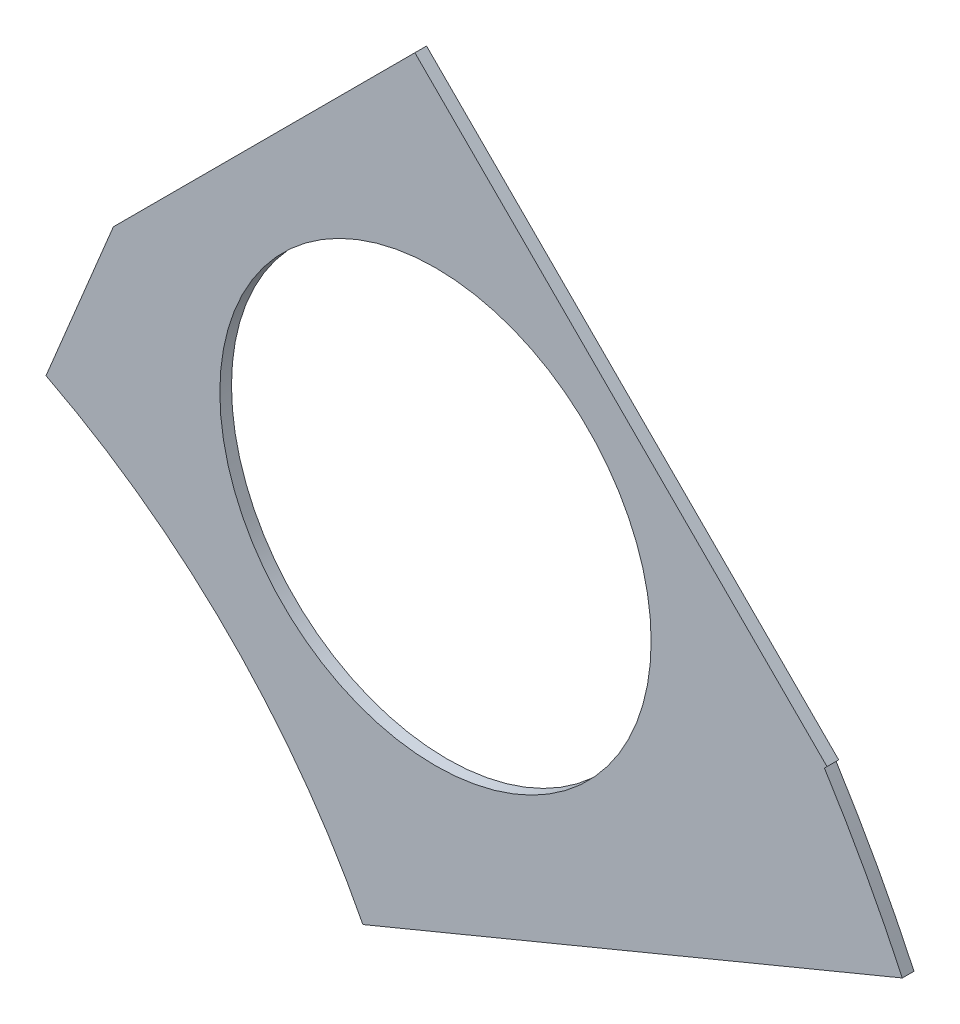
ISO-10303-21;
HEADER;
FILE_DESCRIPTION(('STEP AP214'),'2;1');
FILE_NAME('part.step','',(''),(''),'','','');
FILE_SCHEMA(('AUTOMOTIVE_DESIGN { 1 0 10303 214 1 1 1 1 }'));
ENDSEC;
DATA;
#1=APPLICATION_CONTEXT('core data for automotive mechanical design processes');
#2=APPLICATION_PROTOCOL_DEFINITION('international standard','automotive_design',2000,#1);
#3=PRODUCT_CONTEXT('',#1,'mechanical');
#4=PRODUCT('Part','Part','',(#3));
#5=PRODUCT_RELATED_PRODUCT_CATEGORY('part','',(#4));
#6=PRODUCT_DEFINITION_FORMATION('','',#4);
#7=PRODUCT_DEFINITION_CONTEXT('part definition',#1,'design');
#8=PRODUCT_DEFINITION('design','',#6,#7);
#9=PRODUCT_DEFINITION_SHAPE('','',#8);
#10=(LENGTH_UNIT() NAMED_UNIT(*) SI_UNIT(.MILLI.,.METRE.));
#11=(NAMED_UNIT(*) PLANE_ANGLE_UNIT() SI_UNIT($,.RADIAN.));
#12=(NAMED_UNIT(*) SI_UNIT($,.STERADIAN.) SOLID_ANGLE_UNIT());
#13=UNCERTAINTY_MEASURE_WITH_UNIT(LENGTH_MEASURE(1.E-05),#10,'distance_accuracy_value','');
#14=(GEOMETRIC_REPRESENTATION_CONTEXT(3) GLOBAL_UNCERTAINTY_ASSIGNED_CONTEXT((#13)) GLOBAL_UNIT_ASSIGNED_CONTEXT((#10,
#11,#12)) REPRESENTATION_CONTEXT('',''));
#15=CARTESIAN_POINT('',(0.,0.,0.));
#16=DIRECTION('',(0.,0.,1.));
#17=DIRECTION('',(1.,0.,0.));
#18=AXIS2_PLACEMENT_3D('',#15,#16,#17);
#19=CARTESIAN_POINT('',(0.,0.,0.254));
#20=DIRECTION('',(0.,0.,-1.));
#21=DIRECTION('',(-1.,0.,0.));
#22=AXIS2_PLACEMENT_3D('',#19,#20,#21);
#23=PLANE('',#22);
#24=CARTESIAN_POINT('',(15.715448211871,15.7154482118711,0.254));
#25=DIRECTION('',(0.,0.,1.));
#26=DIRECTION('',(1.,0.,0.));
#27=AXIS2_PLACEMENT_3D('',#24,#25,#26);
#28=CIRCLE('',#27,4.699);
#29=CARTESIAN_POINT('',(20.414448211871,15.7154482118711,0.254));
#30=VERTEX_POINT('',#29);
#31=EDGE_CURVE('E113',#30,#30,#28,.T.);
#32=ORIENTED_EDGE('',*,*,#31,.F.);
#33=EDGE_LOOP('',(#32));
#34=FACE_BOUND('',#33,.T.);
#35=DIRECTION('',(-0.707106781186546,-0.707106781186549,0.));
#36=VECTOR('',#35,1.);
#37=CARTESIAN_POINT('',(67.191354125102,58.2110980040331,0.254));
#38=LINE('',#37,#36);
#39=CARTESIAN_POINT('',(24.2466915268867,15.2664354058176,0.254));
#40=VERTEX_POINT('',#39);
#41=CARTESIAN_POINT('',(24.190484973545,15.210228852476,0.254));
#42=VERTEX_POINT('',#41);
#43=EDGE_CURVE('E103',#40,#42,#38,.T.);
#44=ORIENTED_EDGE('',*,*,#43,.F.);
#45=DIRECTION('',(0.707106781186547,-0.707106781186547,0.));
#46=VECTOR('',#45,1.);
#47=CARTESIAN_POINT('',(15.2664354058174,24.2466915268868,0.254));
#48=LINE('',#47,#46);
#49=CARTESIAN_POINT('',(15.2664354058174,24.2466915268868,0.254));
#50=VERTEX_POINT('',#49);
#51=EDGE_CURVE('E122',#50,#40,#48,.T.);
#52=ORIENTED_EDGE('',*,*,#51,.F.);
#53=DIRECTION('',(-0.707106781186546,-0.707106781186549,0.));
#54=VECTOR('',#53,1.);
#55=CARTESIAN_POINT('',(67.2114671100052,76.1917232310746,0.254));
#56=LINE('',#55,#54);
#57=CARTESIAN_POINT('',(8.69665401257858,17.6769101336478,0.254));
#58=VERTEX_POINT('',#57);
#59=EDGE_CURVE('E93',#50,#58,#56,.T.);
#60=ORIENTED_EDGE('',*,*,#59,.T.);
#61=DIRECTION('',(-0.382683432365086,-0.923879532511288,0.));
#62=VECTOR('',#61,1.);
#63=CARTESIAN_POINT('',(8.69665401257858,17.6769101336478,0.254));
#64=LINE('',#63,#62);
#65=CARTESIAN_POINT('',(7.2289549722772,14.1335712050702,0.254));
#66=VERTEX_POINT('',#65);
#67=EDGE_CURVE('E59',#58,#66,#64,.T.);
#68=ORIENTED_EDGE('',*,*,#67,.T.);
#69=CARTESIAN_POINT('',(0.,0.,0.254));
#70=DIRECTION('',(0.,0.,-1.));
#71=DIRECTION('',(-1.,0.,0.));
#72=AXIS2_PLACEMENT_3D('',#69,#70,#71);
#73=CIRCLE('',#72,15.875);
#74=CARTESIAN_POINT('',(14.1335712050701,7.22895497227725,0.254));
#75=VERTEX_POINT('',#74);
#76=EDGE_CURVE('E87',#66,#75,#73,.T.);
#77=ORIENTED_EDGE('',*,*,#76,.T.);
#78=DIRECTION('',(-0.923879532511287,-0.38268343236509,0.));
#79=VECTOR('',#78,1.);
#80=CARTESIAN_POINT('',(13.5939161163683,7.00542251553331,0.254));
#81=LINE('',#80,#79);
#82=CARTESIAN_POINT('',(25.8877628601839,12.097700570558,0.254));
#83=VERTEX_POINT('',#82);
#84=EDGE_CURVE('E126',#83,#75,#81,.T.);
#85=ORIENTED_EDGE('',*,*,#84,.F.);
#86=CARTESIAN_POINT('',(0.,0.,0.254));
#87=DIRECTION('',(0.,0.,-1.));
#88=DIRECTION('',(-1.,0.,0.));
#89=AXIS2_PLACEMENT_3D('',#86,#87,#88);
#90=CIRCLE('',#89,28.575);
#91=EDGE_CURVE('E105',#42,#83,#90,.T.);
#92=ORIENTED_EDGE('',*,*,#91,.F.);
#93=EDGE_LOOP('',(#44,#52,#60,#68,#77,#85,#92));
#94=FACE_BOUND('',#93,.T.);
#95=ADVANCED_FACE('F35',(#34,#94),#23,.F.);
#96=CARTESIAN_POINT('',(0.,0.,0.));
#97=DIRECTION('',(0.,0.,-1.));
#98=DIRECTION('',(-1.,0.,0.));
#99=AXIS2_PLACEMENT_3D('',#96,#97,#98);
#100=PLANE('',#99);
#101=CARTESIAN_POINT('',(15.715448211871,15.7154482118711,0.));
#102=DIRECTION('',(0.,0.,1.));
#103=DIRECTION('',(1.,0.,0.));
#104=AXIS2_PLACEMENT_3D('',#101,#102,#103);
#105=CIRCLE('',#104,4.699);
#106=CARTESIAN_POINT('',(20.414448211871,15.7154482118711,0.));
#107=VERTEX_POINT('',#106);
#108=EDGE_CURVE('E108',#107,#107,#105,.T.);
#109=ORIENTED_EDGE('',*,*,#108,.T.);
#110=EDGE_LOOP('',(#109));
#111=FACE_BOUND('',#110,.T.);
#112=DIRECTION('',(0.707106781186547,-0.707106781186547,0.));
#113=VECTOR('',#112,1.);
#114=CARTESIAN_POINT('',(15.2664354058174,24.2466915268868,0.));
#115=LINE('',#114,#113);
#116=CARTESIAN_POINT('',(15.2664354058174,24.2466915268868,0.));
#117=VERTEX_POINT('',#116);
#118=CARTESIAN_POINT('',(24.2466915268867,15.2664354058176,0.));
#119=VERTEX_POINT('',#118);
#120=EDGE_CURVE('E121',#117,#119,#115,.T.);
#121=ORIENTED_EDGE('',*,*,#120,.T.);
#122=DIRECTION('',(-0.707106781186546,-0.707106781186549,0.));
#123=VECTOR('',#122,1.);
#124=CARTESIAN_POINT('',(67.191354125102,58.2110980040331,0.));
#125=LINE('',#124,#123);
#126=CARTESIAN_POINT('',(24.190484973545,15.210228852476,0.));
#127=VERTEX_POINT('',#126);
#128=EDGE_CURVE('E50',#119,#127,#125,.T.);
#129=ORIENTED_EDGE('',*,*,#128,.T.);
#130=CARTESIAN_POINT('',(0.,0.,0.));
#131=DIRECTION('',(0.,0.,-1.));
#132=DIRECTION('',(-1.,0.,0.));
#133=AXIS2_PLACEMENT_3D('',#130,#131,#132);
#134=CIRCLE('',#133,28.575);
#135=CARTESIAN_POINT('',(25.8877628601839,12.097700570558,0.));
#136=VERTEX_POINT('',#135);
#137=EDGE_CURVE('E106',#127,#136,#134,.T.);
#138=ORIENTED_EDGE('',*,*,#137,.T.);
#139=DIRECTION('',(-0.923879532511287,-0.38268343236509,0.));
#140=VECTOR('',#139,1.);
#141=CARTESIAN_POINT('',(13.5939161163683,7.00542251553331,0.));
#142=LINE('',#141,#140);
#143=CARTESIAN_POINT('',(14.1335712050701,7.22895497227725,0.));
#144=VERTEX_POINT('',#143);
#145=EDGE_CURVE('E92',#136,#144,#142,.T.);
#146=ORIENTED_EDGE('',*,*,#145,.T.);
#147=CARTESIAN_POINT('',(0.,0.,0.));
#148=DIRECTION('',(0.,0.,-1.));
#149=DIRECTION('',(-1.,0.,0.));
#150=AXIS2_PLACEMENT_3D('',#147,#148,#149);
#151=CIRCLE('',#150,15.875);
#152=CARTESIAN_POINT('',(7.2289549722772,14.1335712050702,0.));
#153=VERTEX_POINT('',#152);
#154=EDGE_CURVE('E80',#153,#144,#151,.T.);
#155=ORIENTED_EDGE('',*,*,#154,.F.);
#156=DIRECTION('',(-0.382683432365086,-0.923879532511288,0.));
#157=VECTOR('',#156,1.);
#158=CARTESIAN_POINT('',(8.69665401257858,17.6769101336478,0.));
#159=LINE('',#158,#157);
#160=CARTESIAN_POINT('',(8.69665401257858,17.6769101336478,0.));
#161=VERTEX_POINT('',#160);
#162=EDGE_CURVE('E72',#161,#153,#159,.T.);
#163=ORIENTED_EDGE('',*,*,#162,.F.);
#164=DIRECTION('',(-0.707106781186546,-0.707106781186549,0.));
#165=VECTOR('',#164,1.);
#166=CARTESIAN_POINT('',(67.2114671100052,76.1917232310746,0.));
#167=LINE('',#166,#165);
#168=EDGE_CURVE('E81',#117,#161,#167,.T.);
#169=ORIENTED_EDGE('',*,*,#168,.F.);
#170=EDGE_LOOP('',(#121,#129,#138,#146,#155,#163,#169));
#171=FACE_BOUND('',#170,.T.);
#172=ADVANCED_FACE('F90',(#111,#171),#100,.T.);
#173=CARTESIAN_POINT('',(0.,0.,0.254));
#174=DIRECTION('',(0.,0.,-1.));
#175=DIRECTION('',(-1.,0.,0.));
#176=AXIS2_PLACEMENT_3D('',#173,#174,#175);
#177=CYLINDRICAL_SURFACE('',#176,28.575);
#178=ORIENTED_EDGE('',*,*,#91,.T.);
#179=DIRECTION('',(0.,0.,-1.));
#180=VECTOR('',#179,1.);
#181=CARTESIAN_POINT('',(25.8877628601839,12.0977005705581,0.254));
#182=LINE('',#181,#180);
#183=EDGE_CURVE('E133',#83,#136,#182,.T.);
#184=ORIENTED_EDGE('',*,*,#183,.T.);
#185=ORIENTED_EDGE('',*,*,#137,.F.);
#186=DIRECTION('',(0.,0.,-1.));
#187=VECTOR('',#186,1.);
#188=CARTESIAN_POINT('',(24.190484973545,15.210228852476,0.254));
#189=LINE('',#188,#187);
#190=EDGE_CURVE('E98',#42,#127,#189,.T.);
#191=ORIENTED_EDGE('',*,*,#190,.F.);
#192=EDGE_LOOP('',(#178,#184,#185,#191));
#193=FACE_BOUND('',#192,.T.);
#194=ADVANCED_FACE('F138',(#193),#177,.T.);
#195=CARTESIAN_POINT('',(67.191354125102,58.2110980040331,0.254));
#196=DIRECTION('',(0.707106781186549,-0.707106781186546,0.));
#197=DIRECTION('',(0.707106781186546,0.707106781186549,0.));
#198=AXIS2_PLACEMENT_3D('',#195,#196,#197);
#199=PLANE('',#198);
#200=ORIENTED_EDGE('',*,*,#128,.F.);
#201=DIRECTION('',(0.,0.,1.));
#202=VECTOR('',#201,1.);
#203=CARTESIAN_POINT('',(24.2466915268867,15.2664354058176,0.254));
#204=LINE('',#203,#202);
#205=EDGE_CURVE('E129',#119,#40,#204,.T.);
#206=ORIENTED_EDGE('',*,*,#205,.T.);
#207=ORIENTED_EDGE('',*,*,#43,.T.);
#208=ORIENTED_EDGE('',*,*,#190,.T.);
#209=EDGE_LOOP('',(#200,#206,#207,#208));
#210=FACE_BOUND('',#209,.T.);
#211=ADVANCED_FACE('F162',(#210),#199,.T.);
#212=CARTESIAN_POINT('',(0.,0.,0.254));
#213=DIRECTION('',(0.,0.,-1.));
#214=DIRECTION('',(-1.,0.,0.));
#215=AXIS2_PLACEMENT_3D('',#212,#213,#214);
#216=CYLINDRICAL_SURFACE('',#215,15.875);
#217=ORIENTED_EDGE('',*,*,#154,.T.);
#218=DIRECTION('',(0.,0.,-1.));
#219=VECTOR('',#218,1.);
#220=CARTESIAN_POINT('',(14.1335712050701,7.22895497227726,0.254));
#221=LINE('',#220,#219);
#222=EDGE_CURVE('E12',#144,#75,#221,.F.);
#223=ORIENTED_EDGE('',*,*,#222,.T.);
#224=ORIENTED_EDGE('',*,*,#76,.F.);
#225=DIRECTION('',(0.,0.,-1.));
#226=VECTOR('',#225,1.);
#227=CARTESIAN_POINT('',(7.2289549722772,14.1335712050702,0.254));
#228=LINE('',#227,#226);
#229=EDGE_CURVE('E75',#66,#153,#228,.T.);
#230=ORIENTED_EDGE('',*,*,#229,.T.);
#231=EDGE_LOOP('',(#217,#223,#224,#230));
#232=FACE_BOUND('',#231,.T.);
#233=ADVANCED_FACE('F85',(#232),#216,.F.);
#234=CARTESIAN_POINT('',(67.2114671100052,76.1917232310746,0.254));
#235=DIRECTION('',(0.707106781186549,-0.707106781186546,0.));
#236=DIRECTION('',(0.707106781186546,0.707106781186549,0.));
#237=AXIS2_PLACEMENT_3D('',#234,#235,#236);
#238=PLANE('',#237);
#239=ORIENTED_EDGE('',*,*,#59,.F.);
#240=DIRECTION('',(0.,0.,1.));
#241=VECTOR('',#240,1.);
#242=CARTESIAN_POINT('',(15.2664354058174,24.2466915268868,0.));
#243=LINE('',#242,#241);
#244=EDGE_CURVE('E116',#117,#50,#243,.T.);
#245=ORIENTED_EDGE('',*,*,#244,.F.);
#246=ORIENTED_EDGE('',*,*,#168,.T.);
#247=DIRECTION('',(0.,0.,-1.));
#248=VECTOR('',#247,1.);
#249=CARTESIAN_POINT('',(8.69665401257858,17.6769101336478,0.254));
#250=LINE('',#249,#248);
#251=EDGE_CURVE('E43',#58,#161,#250,.T.);
#252=ORIENTED_EDGE('',*,*,#251,.F.);
#253=EDGE_LOOP('',(#239,#245,#246,#252));
#254=FACE_BOUND('',#253,.T.);
#255=ADVANCED_FACE('F37',(#254),#238,.F.);
#256=CARTESIAN_POINT('',(8.69665401257858,17.6769101336478,0.254));
#257=DIRECTION('',(0.923879532511288,-0.382683432365086,0.));
#258=DIRECTION('',(0.382683432365086,0.923879532511288,0.));
#259=AXIS2_PLACEMENT_3D('',#256,#257,#258);
#260=PLANE('',#259);
#261=ORIENTED_EDGE('',*,*,#162,.T.);
#262=ORIENTED_EDGE('',*,*,#229,.F.);
#263=ORIENTED_EDGE('',*,*,#67,.F.);
#264=ORIENTED_EDGE('',*,*,#251,.T.);
#265=EDGE_LOOP('',(#261,#262,#263,#264));
#266=FACE_BOUND('',#265,.T.);
#267=ADVANCED_FACE('F74',(#266),#260,.F.);
#268=CARTESIAN_POINT('',(15.715448211871,15.7154482118711,0.));
#269=DIRECTION('',(0.,0.,1.));
#270=DIRECTION('',(1.,0.,0.));
#271=AXIS2_PLACEMENT_3D('',#268,#269,#270);
#272=CYLINDRICAL_SURFACE('',#271,4.699);
#273=ORIENTED_EDGE('',*,*,#108,.F.);
#274=EDGE_LOOP('',(#273));
#275=FACE_BOUND('',#274,.T.);
#276=ORIENTED_EDGE('',*,*,#31,.T.);
#277=EDGE_LOOP('',(#276));
#278=FACE_BOUND('',#277,.T.);
#279=ADVANCED_FACE('F179',(#275,#278),#272,.F.);
#280=CARTESIAN_POINT('',(15.2664354058174,24.2466915268868,0.));
#281=DIRECTION('',(-0.707106781186548,-0.707106781186548,0.));
#282=DIRECTION('',(0.707106781186548,-0.707106781186548,0.));
#283=AXIS2_PLACEMENT_3D('',#280,#281,#282);
#284=PLANE('',#283);
#285=ORIENTED_EDGE('',*,*,#51,.T.);
#286=ORIENTED_EDGE('',*,*,#205,.F.);
#287=ORIENTED_EDGE('',*,*,#120,.F.);
#288=ORIENTED_EDGE('',*,*,#244,.T.);
#289=EDGE_LOOP('',(#285,#286,#287,#288));
#290=FACE_BOUND('',#289,.T.);
#291=ADVANCED_FACE('F184',(#290),#284,.F.);
#292=CARTESIAN_POINT('',(13.5939161163683,7.00542251553331,0.));
#293=DIRECTION('',(-0.38268343236509,0.923879532511287,0.));
#294=DIRECTION('',(-0.923879532511287,-0.38268343236509,0.));
#295=AXIS2_PLACEMENT_3D('',#292,#293,#294);
#296=PLANE('',#295);
#297=ORIENTED_EDGE('',*,*,#145,.F.);
#298=ORIENTED_EDGE('',*,*,#183,.F.);
#299=ORIENTED_EDGE('',*,*,#84,.T.);
#300=ORIENTED_EDGE('',*,*,#222,.F.);
#301=EDGE_LOOP('',(#297,#298,#299,#300));
#302=FACE_BOUND('',#301,.T.);
#303=ADVANCED_FACE('F145',(#302),#296,.F.);
#304=CLOSED_SHELL('',(#95,#172,#194,#211,#233,#255,#267,#279,#291,#303));
#305=MANIFOLD_SOLID_BREP('B2',#304);
#306=ADVANCED_BREP_SHAPE_REPRESENTATION('',(#18,#305),#14);
#307=SHAPE_DEFINITION_REPRESENTATION(#9,#306);
ENDSEC;
END-ISO-10303-21;
